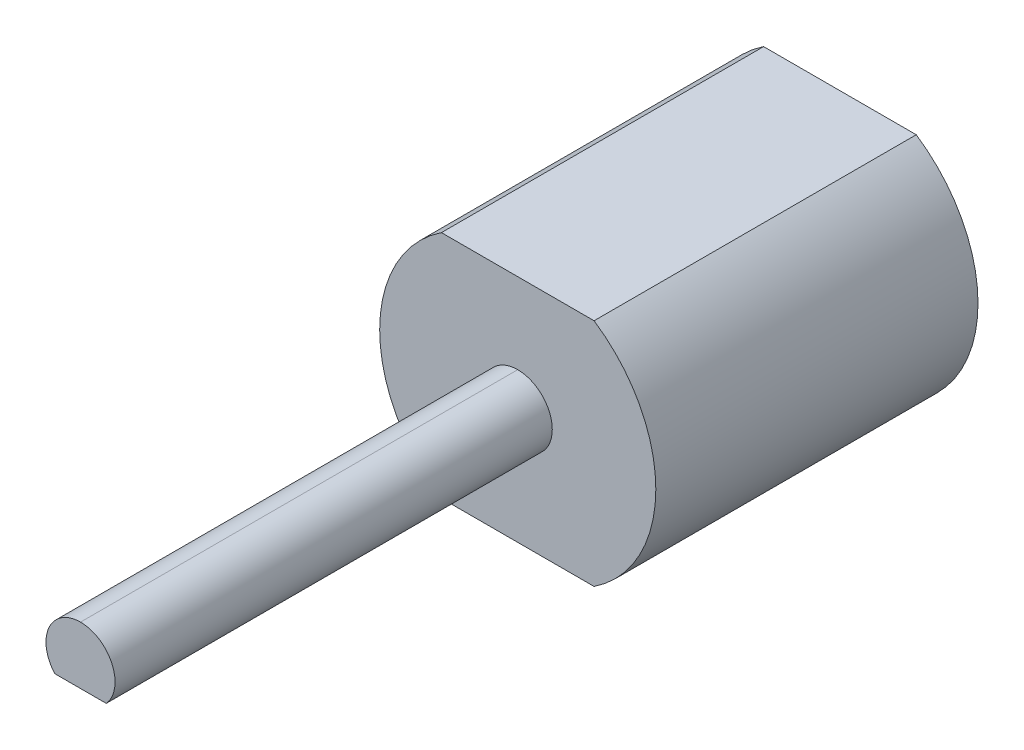
ISO-10303-21;
HEADER;
FILE_DESCRIPTION(('STEP AP214'),'2;1');
FILE_NAME('part.step','',(''),(''),'','','');
FILE_SCHEMA(('AUTOMOTIVE_DESIGN { 1 0 10303 214 1 1 1 1 }'));
ENDSEC;
DATA;
#1=APPLICATION_CONTEXT('core data for automotive mechanical design processes');
#2=APPLICATION_PROTOCOL_DEFINITION('international standard','automotive_design',2000,#1);
#3=PRODUCT_CONTEXT('',#1,'mechanical');
#4=PRODUCT('Part','Part','',(#3));
#5=PRODUCT_RELATED_PRODUCT_CATEGORY('part','',(#4));
#6=PRODUCT_DEFINITION_FORMATION('','',#4);
#7=PRODUCT_DEFINITION_CONTEXT('part definition',#1,'design');
#8=PRODUCT_DEFINITION('design','',#6,#7);
#9=PRODUCT_DEFINITION_SHAPE('','',#8);
#10=(LENGTH_UNIT() NAMED_UNIT(*) SI_UNIT(.MILLI.,.METRE.));
#11=(NAMED_UNIT(*) PLANE_ANGLE_UNIT() SI_UNIT($,.RADIAN.));
#12=(NAMED_UNIT(*) SI_UNIT($,.STERADIAN.) SOLID_ANGLE_UNIT());
#13=UNCERTAINTY_MEASURE_WITH_UNIT(LENGTH_MEASURE(1.E-05),#10,'distance_accuracy_value','');
#14=(GEOMETRIC_REPRESENTATION_CONTEXT(3) GLOBAL_UNCERTAINTY_ASSIGNED_CONTEXT((#13)) GLOBAL_UNIT_ASSIGNED_CONTEXT((#10,
#11,#12)) REPRESENTATION_CONTEXT('',''));
#15=CARTESIAN_POINT('',(0.,0.,0.));
#16=DIRECTION('',(0.,0.,1.));
#17=DIRECTION('',(1.,0.,0.));
#18=AXIS2_PLACEMENT_3D('',#15,#16,#17);
#19=CARTESIAN_POINT('',(0.,0.,14.));
#20=DIRECTION('',(0.,0.,-1.));
#21=DIRECTION('',(0.,1.,0.));
#22=AXIS2_PLACEMENT_3D('',#19,#20,#21);
#23=CYLINDRICAL_SURFACE('',#22,1.5);
#24=DIRECTION('',(0.,0.,1.));
#25=VECTOR('',#24,1.);
#26=CARTESIAN_POINT('',(1.11803398874989,-1.,25.));
#27=LINE('',#26,#25);
#28=CARTESIAN_POINT('',(1.11803398874989,-1.,25.));
#29=VERTEX_POINT('',#28);
#30=CARTESIAN_POINT('',(1.11803398874989,-1.,33.));
#31=VERTEX_POINT('',#30);
#32=EDGE_CURVE('E66',#29,#31,#27,.T.);
#33=ORIENTED_EDGE('',*,*,#32,.F.);
#34=CARTESIAN_POINT('',(0.,0.,25.));
#35=DIRECTION('',(0.,0.,1.));
#36=DIRECTION('',(1.,0.,0.));
#37=AXIS2_PLACEMENT_3D('',#34,#35,#36);
#38=CIRCLE('',#37,1.5);
#39=CARTESIAN_POINT('',(0.,-1.49999999999999,25.));
#40=VERTEX_POINT('',#39);
#41=EDGE_CURVE('E129',#40,#29,#38,.T.);
#42=ORIENTED_EDGE('',*,*,#41,.F.);
#43=DIRECTION('',(0.,0.,-1.));
#44=VECTOR('',#43,1.);
#45=CARTESIAN_POINT('',(0.,-1.5,14.));
#46=LINE('',#45,#44);
#47=CARTESIAN_POINT('',(0.,-1.5,14.));
#48=VERTEX_POINT('',#47);
#49=EDGE_CURVE('E58',#40,#48,#46,.T.);
#50=ORIENTED_EDGE('',*,*,#49,.T.);
#51=CARTESIAN_POINT('',(0.,0.,14.));
#52=DIRECTION('',(0.,0.,1.));
#53=DIRECTION('',(0.,1.,0.));
#54=AXIS2_PLACEMENT_3D('',#51,#52,#53);
#55=CIRCLE('',#54,1.5);
#56=CARTESIAN_POINT('',(0.,1.5,14.));
#57=VERTEX_POINT('',#56);
#58=EDGE_CURVE('E161',#48,#57,#55,.T.);
#59=ORIENTED_EDGE('',*,*,#58,.T.);
#60=DIRECTION('',(0.,0.,-1.));
#61=VECTOR('',#60,1.);
#62=CARTESIAN_POINT('',(0.,1.5,14.));
#63=LINE('',#62,#61);
#64=CARTESIAN_POINT('',(0.,1.5,33.));
#65=VERTEX_POINT('',#64);
#66=EDGE_CURVE('E168',#65,#57,#63,.T.);
#67=ORIENTED_EDGE('',*,*,#66,.F.);
#68=CARTESIAN_POINT('',(0.,0.,33.));
#69=DIRECTION('',(0.,0.,-1.));
#70=DIRECTION('',(0.,1.,0.));
#71=AXIS2_PLACEMENT_3D('',#68,#69,#70);
#72=CIRCLE('',#71,1.5);
#73=EDGE_CURVE('E11',#65,#31,#72,.T.);
#74=ORIENTED_EDGE('',*,*,#73,.T.);
#75=EDGE_LOOP('',(#33,#42,#50,#59,#67,#74));
#76=FACE_BOUND('',#75,.T.);
#77=ADVANCED_FACE('F48',(#76),#23,.T.);
#78=CARTESIAN_POINT('',(0.,0.,14.));
#79=DIRECTION('',(0.,0.,-1.));
#80=DIRECTION('',(0.,1.,0.));
#81=AXIS2_PLACEMENT_3D('',#78,#79,#80);
#82=CYLINDRICAL_SURFACE('',#81,1.5);
#83=DIRECTION('',(0.,0.,1.));
#84=VECTOR('',#83,1.);
#85=CARTESIAN_POINT('',(-1.11803398874989,-1.,25.));
#86=LINE('',#85,#84);
#87=CARTESIAN_POINT('',(-1.11803398874989,-1.,25.));
#88=VERTEX_POINT('',#87);
#89=CARTESIAN_POINT('',(-1.11803398874989,-1.,33.));
#90=VERTEX_POINT('',#89);
#91=EDGE_CURVE('E139',#88,#90,#86,.T.);
#92=ORIENTED_EDGE('',*,*,#91,.T.);
#93=CARTESIAN_POINT('',(0.,0.,33.));
#94=DIRECTION('',(0.,0.,-1.));
#95=DIRECTION('',(0.,1.,0.));
#96=AXIS2_PLACEMENT_3D('',#93,#94,#95);
#97=CIRCLE('',#96,1.5);
#98=EDGE_CURVE('E171',#90,#65,#97,.T.);
#99=ORIENTED_EDGE('',*,*,#98,.T.);
#100=ORIENTED_EDGE('',*,*,#66,.T.);
#101=CARTESIAN_POINT('',(0.,0.,14.));
#102=DIRECTION('',(0.,0.,1.));
#103=DIRECTION('',(0.,1.,0.));
#104=AXIS2_PLACEMENT_3D('',#101,#102,#103);
#105=CIRCLE('',#104,1.5);
#106=EDGE_CURVE('E172',#57,#48,#105,.T.);
#107=ORIENTED_EDGE('',*,*,#106,.T.);
#108=ORIENTED_EDGE('',*,*,#49,.F.);
#109=EDGE_CURVE('E133',#88,#40,#38,.T.);
#110=ORIENTED_EDGE('',*,*,#109,.F.);
#111=EDGE_LOOP('',(#92,#99,#100,#107,#108,#110));
#112=FACE_BOUND('',#111,.T.);
#113=ADVANCED_FACE('F208',(#112),#82,.T.);
#114=CARTESIAN_POINT('',(-3.316624790358,-4.999999999999,14.));
#115=DIRECTION('',(0.,0.,-1.));
#116=DIRECTION('',(0.,-1.,0.));
#117=AXIS2_PLACEMENT_3D('',#114,#115,#116);
#118=PLANE('',#117);
#119=DIRECTION('',(1.,0.,0.));
#120=VECTOR('',#119,1.);
#121=CARTESIAN_POINT('',(-3.316624790358,5.,14.));
#122=LINE('',#121,#120);
#123=CARTESIAN_POINT('',(-3.31662479035521,4.9999999999995,14.));
#124=VERTEX_POINT('',#123);
#125=CARTESIAN_POINT('',(3.31662479035619,4.99999999999948,14.));
#126=VERTEX_POINT('',#125);
#127=EDGE_CURVE('E158',#124,#126,#122,.T.);
#128=ORIENTED_EDGE('',*,*,#127,.F.);
#129=CARTESIAN_POINT('',(0.,0.,14.));
#130=DIRECTION('',(0.,0.,-1.));
#131=DIRECTION('',(0.,1.,0.));
#132=AXIS2_PLACEMENT_3D('',#129,#130,#131);
#133=CIRCLE('',#132,6.);
#134=CARTESIAN_POINT('',(-3.31662479035728,-4.99999999999875,14.));
#135=VERTEX_POINT('',#134);
#136=EDGE_CURVE('E52',#135,#124,#133,.T.);
#137=ORIENTED_EDGE('',*,*,#136,.F.);
#138=DIRECTION('',(-1.,0.,0.));
#139=VECTOR('',#138,1.);
#140=CARTESIAN_POINT('',(-3.316624790358,-4.999999999999,14.));
#141=LINE('',#140,#139);
#142=CARTESIAN_POINT('',(3.31662479035659,-4.99999999999921,14.));
#143=VERTEX_POINT('',#142);
#144=EDGE_CURVE('E167',#143,#135,#141,.T.);
#145=ORIENTED_EDGE('',*,*,#144,.F.);
#146=CARTESIAN_POINT('',(0.,0.,14.));
#147=DIRECTION('',(0.,0.,-1.));
#148=DIRECTION('',(0.,1.,0.));
#149=AXIS2_PLACEMENT_3D('',#146,#147,#148);
#150=CIRCLE('',#149,6.);
#151=EDGE_CURVE('E177',#126,#143,#150,.T.);
#152=ORIENTED_EDGE('',*,*,#151,.F.);
#153=EDGE_LOOP('',(#128,#137,#145,#152));
#154=FACE_BOUND('',#153,.T.);
#155=ORIENTED_EDGE('',*,*,#106,.F.);
#156=ORIENTED_EDGE('',*,*,#58,.F.);
#157=EDGE_LOOP('',(#155,#156));
#158=FACE_BOUND('',#157,.T.);
#159=ADVANCED_FACE('F210',(#154,#158),#118,.F.);
#160=CARTESIAN_POINT('',(1.5,0.,33.));
#161=DIRECTION('',(0.,0.,-1.));
#162=DIRECTION('',(-1.,0.,0.));
#163=AXIS2_PLACEMENT_3D('',#160,#161,#162);
#164=PLANE('',#163);
#165=ORIENTED_EDGE('',*,*,#98,.F.);
#166=DIRECTION('',(-1.,0.,0.));
#167=VECTOR('',#166,1.);
#168=CARTESIAN_POINT('',(0.,-1.,33.));
#169=LINE('',#168,#167);
#170=EDGE_CURVE('E135',#31,#90,#169,.T.);
#171=ORIENTED_EDGE('',*,*,#170,.F.);
#172=ORIENTED_EDGE('',*,*,#73,.F.);
#173=EDGE_LOOP('',(#165,#171,#172));
#174=FACE_BOUND('',#173,.T.);
#175=ADVANCED_FACE('F213',(#174),#164,.F.);
#176=CARTESIAN_POINT('',(0.,0.,0.));
#177=DIRECTION('',(0.,0.,-1.));
#178=DIRECTION('',(0.,1.,0.));
#179=AXIS2_PLACEMENT_3D('',#176,#177,#178);
#180=CYLINDRICAL_SURFACE('',#179,6.);
#181=ORIENTED_EDGE('',*,*,#151,.T.);
#182=DIRECTION('',(0.,0.,-1.));
#183=VECTOR('',#182,1.);
#184=CARTESIAN_POINT('',(3.31662479035628,-4.99999999999942,0.));
#185=LINE('',#184,#183);
#186=CARTESIAN_POINT('',(3.31662479035659,-4.99999999999921,0.));
#187=VERTEX_POINT('',#186);
#188=EDGE_CURVE('E181',#143,#187,#185,.T.);
#189=ORIENTED_EDGE('',*,*,#188,.T.);
#190=CARTESIAN_POINT('',(0.,0.,0.));
#191=DIRECTION('',(0.,0.,1.));
#192=DIRECTION('',(0.,1.,0.));
#193=AXIS2_PLACEMENT_3D('',#190,#191,#192);
#194=CIRCLE('',#193,6.);
#195=CARTESIAN_POINT('',(3.31662479035694,4.99999999999898,0.));
#196=VERTEX_POINT('',#195);
#197=EDGE_CURVE('E157',#187,#196,#194,.T.);
#198=ORIENTED_EDGE('',*,*,#197,.T.);
#199=DIRECTION('',(0.,0.,1.));
#200=VECTOR('',#199,1.);
#201=CARTESIAN_POINT('',(3.31662479035697,4.99999999999896,0.));
#202=LINE('',#201,#200);
#203=EDGE_CURVE('E153',#196,#126,#202,.T.);
#204=ORIENTED_EDGE('',*,*,#203,.T.);
#205=EDGE_LOOP('',(#181,#189,#198,#204));
#206=FACE_BOUND('',#205,.T.);
#207=ADVANCED_FACE('F236',(#206),#180,.T.);
#208=CARTESIAN_POINT('',(3.316624790357,4.999999999999,0.));
#209=DIRECTION('',(0.,-1.,0.));
#210=DIRECTION('',(-1.,0.,0.));
#211=AXIS2_PLACEMENT_3D('',#208,#209,#210);
#212=PLANE('',#211);
#213=DIRECTION('',(0.,0.,-1.));
#214=VECTOR('',#213,1.);
#215=CARTESIAN_POINT('',(-3.316624790355,4.999999999999,0.));
#216=LINE('',#215,#214);
#217=CARTESIAN_POINT('',(-3.31662479035595,4.999999999999,0.));
#218=VERTEX_POINT('',#217);
#219=EDGE_CURVE('E182',#124,#218,#216,.T.);
#220=ORIENTED_EDGE('',*,*,#219,.F.);
#221=ORIENTED_EDGE('',*,*,#127,.T.);
#222=ORIENTED_EDGE('',*,*,#203,.F.);
#223=DIRECTION('',(1.,0.,0.));
#224=VECTOR('',#223,1.);
#225=CARTESIAN_POINT('',(3.316624790357,4.999999999999,0.));
#226=LINE('',#225,#224);
#227=EDGE_CURVE('E149',#218,#196,#226,.T.);
#228=ORIENTED_EDGE('',*,*,#227,.F.);
#229=EDGE_LOOP('',(#220,#221,#222,#228));
#230=FACE_BOUND('',#229,.T.);
#231=ADVANCED_FACE('F229',(#230),#212,.F.);
#232=CARTESIAN_POINT('',(0.,0.,0.));
#233=DIRECTION('',(0.,0.,-1.));
#234=DIRECTION('',(0.,1.,0.));
#235=AXIS2_PLACEMENT_3D('',#232,#233,#234);
#236=CYLINDRICAL_SURFACE('',#235,6.);
#237=ORIENTED_EDGE('',*,*,#136,.T.);
#238=ORIENTED_EDGE('',*,*,#219,.T.);
#239=CARTESIAN_POINT('',(0.,0.,0.));
#240=DIRECTION('',(0.,0.,1.));
#241=DIRECTION('',(0.,1.,0.));
#242=AXIS2_PLACEMENT_3D('',#239,#240,#241);
#243=CIRCLE('',#242,6.);
#244=CARTESIAN_POINT('',(-3.31662479035728,-4.99999999999875,0.));
#245=VERTEX_POINT('',#244);
#246=EDGE_CURVE('E166',#218,#245,#243,.T.);
#247=ORIENTED_EDGE('',*,*,#246,.T.);
#248=DIRECTION('',(0.,0.,1.));
#249=VECTOR('',#248,1.);
#250=CARTESIAN_POINT('',(-3.31662479035767,-4.9999999999985,0.));
#251=LINE('',#250,#249);
#252=EDGE_CURVE('E162',#245,#135,#251,.T.);
#253=ORIENTED_EDGE('',*,*,#252,.T.);
#254=EDGE_LOOP('',(#237,#238,#247,#253));
#255=FACE_BOUND('',#254,.T.);
#256=ADVANCED_FACE('F235',(#255),#236,.T.);
#257=CARTESIAN_POINT('',(-3.316624790358,-4.999999999999,0.));
#258=DIRECTION('',(0.,1.,0.));
#259=DIRECTION('',(1.,0.,0.));
#260=AXIS2_PLACEMENT_3D('',#257,#258,#259);
#261=PLANE('',#260);
#262=ORIENTED_EDGE('',*,*,#188,.F.);
#263=ORIENTED_EDGE('',*,*,#144,.T.);
#264=ORIENTED_EDGE('',*,*,#252,.F.);
#265=DIRECTION('',(-1.,0.,0.));
#266=VECTOR('',#265,1.);
#267=CARTESIAN_POINT('',(-3.316624790358,-4.999999999999,0.));
#268=LINE('',#267,#266);
#269=EDGE_CURVE('E175',#187,#245,#268,.T.);
#270=ORIENTED_EDGE('',*,*,#269,.F.);
#271=EDGE_LOOP('',(#262,#263,#264,#270));
#272=FACE_BOUND('',#271,.T.);
#273=ADVANCED_FACE('F50',(#272),#261,.F.);
#274=CARTESIAN_POINT('',(-3.316624790358,-4.999999999999,0.));
#275=DIRECTION('',(0.,0.,-1.));
#276=DIRECTION('',(0.,-1.,0.));
#277=AXIS2_PLACEMENT_3D('',#274,#275,#276);
#278=PLANE('',#277);
#279=ORIENTED_EDGE('',*,*,#197,.F.);
#280=ORIENTED_EDGE('',*,*,#269,.T.);
#281=ORIENTED_EDGE('',*,*,#246,.F.);
#282=ORIENTED_EDGE('',*,*,#227,.T.);
#283=EDGE_LOOP('',(#279,#280,#281,#282));
#284=FACE_BOUND('',#283,.T.);
#285=ADVANCED_FACE('F269',(#284),#278,.T.);
#286=CARTESIAN_POINT('',(0.,-1.,25.));
#287=DIRECTION('',(0.,1.,0.));
#288=DIRECTION('',(0.,0.,1.));
#289=AXIS2_PLACEMENT_3D('',#286,#287,#288);
#290=PLANE('',#289);
#291=ORIENTED_EDGE('',*,*,#170,.T.);
#292=ORIENTED_EDGE('',*,*,#91,.F.);
#293=DIRECTION('',(-1.,0.,0.));
#294=VECTOR('',#293,1.);
#295=CARTESIAN_POINT('',(0.,-1.,25.));
#296=LINE('',#295,#294);
#297=EDGE_CURVE('E131',#29,#88,#296,.T.);
#298=ORIENTED_EDGE('',*,*,#297,.F.);
#299=ORIENTED_EDGE('',*,*,#32,.T.);
#300=EDGE_LOOP('',(#291,#292,#298,#299));
#301=FACE_BOUND('',#300,.T.);
#302=ADVANCED_FACE('F137',(#301),#290,.F.);
#303=CARTESIAN_POINT('',(0.,0.,25.));
#304=DIRECTION('',(0.,0.,1.));
#305=DIRECTION('',(1.,0.,0.));
#306=AXIS2_PLACEMENT_3D('',#303,#304,#305);
#307=PLANE('',#306);
#308=ORIENTED_EDGE('',*,*,#109,.T.);
#309=ORIENTED_EDGE('',*,*,#41,.T.);
#310=ORIENTED_EDGE('',*,*,#297,.T.);
#311=EDGE_LOOP('',(#308,#309,#310));
#312=FACE_BOUND('',#311,.T.);
#313=ADVANCED_FACE('F130',(#312),#307,.T.);
#314=CLOSED_SHELL('',(#77,#113,#159,#175,#207,#231,#256,#273,#285,#302,#313));
#315=MANIFOLD_SOLID_BREP('B2',#314);
#316=ADVANCED_BREP_SHAPE_REPRESENTATION('',(#18,#315),#14);
#317=SHAPE_DEFINITION_REPRESENTATION(#9,#316);
ENDSEC;
END-ISO-10303-21;
